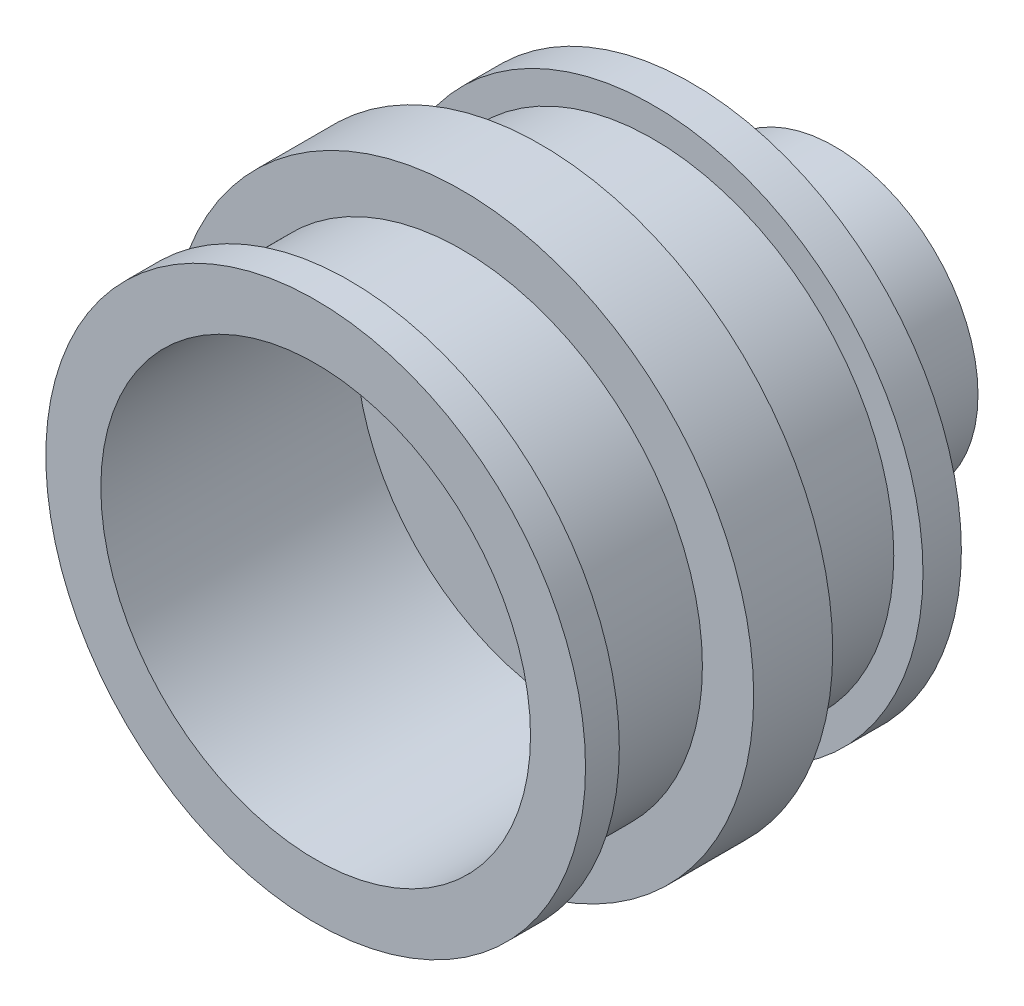
ISO-10303-21;
HEADER;
FILE_DESCRIPTION(('STEP AP214'),'2;1');
FILE_NAME('part.step','',(''),(''),'','','');
FILE_SCHEMA(('AUTOMOTIVE_DESIGN { 1 0 10303 214 1 1 1 1 }'));
ENDSEC;
DATA;
#1=APPLICATION_CONTEXT('core data for automotive mechanical design processes');
#2=APPLICATION_PROTOCOL_DEFINITION('international standard','automotive_design',2000,#1);
#3=PRODUCT_CONTEXT('',#1,'mechanical');
#4=PRODUCT('Part','Part','',(#3));
#5=PRODUCT_RELATED_PRODUCT_CATEGORY('part','',(#4));
#6=PRODUCT_DEFINITION_FORMATION('','',#4);
#7=PRODUCT_DEFINITION_CONTEXT('part definition',#1,'design');
#8=PRODUCT_DEFINITION('design','',#6,#7);
#9=PRODUCT_DEFINITION_SHAPE('','',#8);
#10=(LENGTH_UNIT() NAMED_UNIT(*) SI_UNIT(.MILLI.,.METRE.));
#11=(NAMED_UNIT(*) PLANE_ANGLE_UNIT() SI_UNIT($,.RADIAN.));
#12=(NAMED_UNIT(*) SI_UNIT($,.STERADIAN.) SOLID_ANGLE_UNIT());
#13=UNCERTAINTY_MEASURE_WITH_UNIT(LENGTH_MEASURE(1.E-05),#10,'distance_accuracy_value','');
#14=(GEOMETRIC_REPRESENTATION_CONTEXT(3) GLOBAL_UNCERTAINTY_ASSIGNED_CONTEXT((#13)) GLOBAL_UNIT_ASSIGNED_CONTEXT((#10,
#11,#12)) REPRESENTATION_CONTEXT('',''));
#15=CARTESIAN_POINT('',(0.,0.,0.));
#16=DIRECTION('',(0.,0.,1.));
#17=DIRECTION('',(1.,0.,0.));
#18=AXIS2_PLACEMENT_3D('',#15,#16,#17);
#19=CARTESIAN_POINT('',(0.,0.,0.));
#20=DIRECTION('',(0.,0.,1.));
#21=DIRECTION('',(1.,0.,0.));
#22=AXIS2_PLACEMENT_3D('',#19,#20,#21);
#23=PLANE('',#22);
#24=CARTESIAN_POINT('',(0.,0.,0.));
#25=DIRECTION('',(0.,0.,1.));
#26=DIRECTION('',(1.,0.,0.));
#27=AXIS2_PLACEMENT_3D('',#24,#25,#26);
#28=CIRCLE('',#27,9.42);
#29=CARTESIAN_POINT('',(9.42,0.,0.));
#30=VERTEX_POINT('',#29);
#31=EDGE_CURVE('E52',#30,#30,#28,.T.);
#32=ORIENTED_EDGE('',*,*,#31,.F.);
#33=EDGE_LOOP('',(#32));
#34=FACE_BOUND('',#33,.T.);
#35=CARTESIAN_POINT('',(0.,0.,0.));
#36=DIRECTION('',(0.,0.,1.));
#37=DIRECTION('',(1.,0.,0.));
#38=AXIS2_PLACEMENT_3D('',#35,#36,#37);
#39=CIRCLE('',#38,5.);
#40=CARTESIAN_POINT('',(5.,0.,0.));
#41=VERTEX_POINT('',#40);
#42=EDGE_CURVE('E10',#41,#41,#39,.F.);
#43=ORIENTED_EDGE('',*,*,#42,.F.);
#44=EDGE_LOOP('',(#43));
#45=FACE_BOUND('',#44,.T.);
#46=ADVANCED_FACE('F34',(#34,#45),#23,.F.);
#47=CARTESIAN_POINT('',(0.,0.,1.34));
#48=DIRECTION('',(0.,0.,-1.));
#49=DIRECTION('',(-1.,0.,0.));
#50=AXIS2_PLACEMENT_3D('',#47,#48,#49);
#51=CYLINDRICAL_SURFACE('',#50,9.42);
#52=CARTESIAN_POINT('',(0.,0.,1.34));
#53=DIRECTION('',(0.,0.,1.));
#54=DIRECTION('',(1.,0.,0.));
#55=AXIS2_PLACEMENT_3D('',#52,#53,#54);
#56=CIRCLE('',#55,9.42);
#57=CARTESIAN_POINT('',(9.42,0.,1.34));
#58=VERTEX_POINT('',#57);
#59=EDGE_CURVE('E47',#58,#58,#56,.T.);
#60=ORIENTED_EDGE('',*,*,#59,.F.);
#61=EDGE_LOOP('',(#60));
#62=FACE_BOUND('',#61,.T.);
#63=ORIENTED_EDGE('',*,*,#31,.T.);
#64=EDGE_LOOP('',(#63));
#65=FACE_BOUND('',#64,.T.);
#66=ADVANCED_FACE('F36',(#62,#65),#51,.T.);
#67=CARTESIAN_POINT('',(0.,0.,1.34));
#68=DIRECTION('',(0.,0.,1.));
#69=DIRECTION('',(1.,0.,0.));
#70=AXIS2_PLACEMENT_3D('',#67,#68,#69);
#71=PLANE('',#70);
#72=CARTESIAN_POINT('',(0.,0.,1.34));
#73=DIRECTION('',(0.,0.,1.));
#74=DIRECTION('',(1.,0.,0.));
#75=AXIS2_PLACEMENT_3D('',#72,#73,#74);
#76=CIRCLE('',#75,8.4);
#77=CARTESIAN_POINT('',(8.4,0.,1.34));
#78=VERTEX_POINT('',#77);
#79=EDGE_CURVE('E146',#78,#78,#76,.T.);
#80=ORIENTED_EDGE('',*,*,#79,.F.);
#81=EDGE_LOOP('',(#80));
#82=FACE_BOUND('',#81,.T.);
#83=ORIENTED_EDGE('',*,*,#59,.T.);
#84=EDGE_LOOP('',(#83));
#85=FACE_BOUND('',#84,.T.);
#86=ADVANCED_FACE('F130',(#82,#85),#71,.T.);
#87=CARTESIAN_POINT('',(0.,0.,5.26));
#88=DIRECTION('',(0.,0.,-1.));
#89=DIRECTION('',(-1.,0.,0.));
#90=AXIS2_PLACEMENT_3D('',#87,#88,#89);
#91=CYLINDRICAL_SURFACE('',#90,8.4);
#92=CARTESIAN_POINT('',(0.,0.,5.26));
#93=DIRECTION('',(0.,0.,1.));
#94=DIRECTION('',(1.,0.,0.));
#95=AXIS2_PLACEMENT_3D('',#92,#93,#94);
#96=CIRCLE('',#95,8.4);
#97=CARTESIAN_POINT('',(8.4,0.,5.26));
#98=VERTEX_POINT('',#97);
#99=EDGE_CURVE('E144',#98,#98,#96,.T.);
#100=ORIENTED_EDGE('',*,*,#99,.F.);
#101=EDGE_LOOP('',(#100));
#102=FACE_BOUND('',#101,.T.);
#103=ORIENTED_EDGE('',*,*,#79,.T.);
#104=EDGE_LOOP('',(#103));
#105=FACE_BOUND('',#104,.T.);
#106=ADVANCED_FACE('F126',(#102,#105),#91,.T.);
#107=CARTESIAN_POINT('',(0.,0.,8.02));
#108=DIRECTION('',(0.,0.,-1.));
#109=DIRECTION('',(-1.,0.,0.));
#110=AXIS2_PLACEMENT_3D('',#107,#108,#109);
#111=CYLINDRICAL_SURFACE('',#110,10.19);
#112=CARTESIAN_POINT('',(0.,0.,8.02));
#113=DIRECTION('',(0.,0.,1.));
#114=DIRECTION('',(1.,0.,0.));
#115=AXIS2_PLACEMENT_3D('',#112,#113,#114);
#116=CIRCLE('',#115,10.19);
#117=CARTESIAN_POINT('',(10.19,0.,8.02));
#118=VERTEX_POINT('',#117);
#119=EDGE_CURVE('E150',#118,#118,#116,.T.);
#120=ORIENTED_EDGE('',*,*,#119,.F.);
#121=EDGE_LOOP('',(#120));
#122=FACE_BOUND('',#121,.T.);
#123=CARTESIAN_POINT('',(0.,0.,5.26));
#124=DIRECTION('',(0.,0.,1.));
#125=DIRECTION('',(1.,0.,0.));
#126=AXIS2_PLACEMENT_3D('',#123,#124,#125);
#127=CIRCLE('',#126,10.19);
#128=CARTESIAN_POINT('',(10.19,0.,5.26));
#129=VERTEX_POINT('',#128);
#130=EDGE_CURVE('E153',#129,#129,#127,.T.);
#131=ORIENTED_EDGE('',*,*,#130,.T.);
#132=EDGE_LOOP('',(#131));
#133=FACE_BOUND('',#132,.T.);
#134=ADVANCED_FACE('F119',(#122,#133),#111,.T.);
#135=CARTESIAN_POINT('',(0.,0.,8.02));
#136=DIRECTION('',(0.,0.,1.));
#137=DIRECTION('',(1.,0.,0.));
#138=AXIS2_PLACEMENT_3D('',#135,#136,#137);
#139=PLANE('',#138);
#140=CARTESIAN_POINT('',(0.,0.,8.02));
#141=DIRECTION('',(0.,0.,1.));
#142=DIRECTION('',(1.,0.,0.));
#143=AXIS2_PLACEMENT_3D('',#140,#141,#142);
#144=CIRCLE('',#143,8.4);
#145=CARTESIAN_POINT('',(8.4,0.,8.02));
#146=VERTEX_POINT('',#145);
#147=EDGE_CURVE('E159',#146,#146,#144,.T.);
#148=ORIENTED_EDGE('',*,*,#147,.F.);
#149=EDGE_LOOP('',(#148));
#150=FACE_BOUND('',#149,.T.);
#151=ORIENTED_EDGE('',*,*,#119,.T.);
#152=EDGE_LOOP('',(#151));
#153=FACE_BOUND('',#152,.T.);
#154=ADVANCED_FACE('F116',(#150,#153),#139,.T.);
#155=CARTESIAN_POINT('',(0.,0.,5.26));
#156=DIRECTION('',(0.,0.,1.));
#157=DIRECTION('',(1.,0.,0.));
#158=AXIS2_PLACEMENT_3D('',#155,#156,#157);
#159=PLANE('',#158);
#160=ORIENTED_EDGE('',*,*,#99,.T.);
#161=EDGE_LOOP('',(#160));
#162=FACE_BOUND('',#161,.T.);
#163=ORIENTED_EDGE('',*,*,#130,.F.);
#164=EDGE_LOOP('',(#163));
#165=FACE_BOUND('',#164,.T.);
#166=ADVANCED_FACE('F114',(#162,#165),#159,.F.);
#167=CARTESIAN_POINT('',(0.,0.,11.94));
#168=DIRECTION('',(0.,0.,-1.));
#169=DIRECTION('',(-1.,0.,0.));
#170=AXIS2_PLACEMENT_3D('',#167,#168,#169);
#171=CYLINDRICAL_SURFACE('',#170,8.4);
#172=CARTESIAN_POINT('',(0.,0.,11.94));
#173=DIRECTION('',(0.,0.,1.));
#174=DIRECTION('',(1.,0.,0.));
#175=AXIS2_PLACEMENT_3D('',#172,#173,#174);
#176=CIRCLE('',#175,8.4);
#177=CARTESIAN_POINT('',(8.4,0.,11.94));
#178=VERTEX_POINT('',#177);
#179=EDGE_CURVE('E156',#178,#178,#176,.T.);
#180=ORIENTED_EDGE('',*,*,#179,.F.);
#181=EDGE_LOOP('',(#180));
#182=FACE_BOUND('',#181,.T.);
#183=ORIENTED_EDGE('',*,*,#147,.T.);
#184=EDGE_LOOP('',(#183));
#185=FACE_BOUND('',#184,.T.);
#186=ADVANCED_FACE('F110',(#182,#185),#171,.T.);
#187=CARTESIAN_POINT('',(0.,0.,13.12));
#188=DIRECTION('',(0.,0.,-1.));
#189=DIRECTION('',(-1.,0.,0.));
#190=AXIS2_PLACEMENT_3D('',#187,#188,#189);
#191=CYLINDRICAL_SURFACE('',#190,9.42);
#192=CARTESIAN_POINT('',(0.,0.,13.12));
#193=DIRECTION('',(0.,0.,1.));
#194=DIRECTION('',(1.,0.,0.));
#195=AXIS2_PLACEMENT_3D('',#192,#193,#194);
#196=CIRCLE('',#195,9.42);
#197=CARTESIAN_POINT('',(9.42,0.,13.12));
#198=VERTEX_POINT('',#197);
#199=EDGE_CURVE('E162',#198,#198,#196,.T.);
#200=ORIENTED_EDGE('',*,*,#199,.F.);
#201=EDGE_LOOP('',(#200));
#202=FACE_BOUND('',#201,.T.);
#203=CARTESIAN_POINT('',(0.,0.,11.94));
#204=DIRECTION('',(0.,0.,1.));
#205=DIRECTION('',(1.,0.,0.));
#206=AXIS2_PLACEMENT_3D('',#203,#204,#205);
#207=CIRCLE('',#206,9.42);
#208=CARTESIAN_POINT('',(9.42,0.,11.94));
#209=VERTEX_POINT('',#208);
#210=EDGE_CURVE('E165',#209,#209,#207,.T.);
#211=ORIENTED_EDGE('',*,*,#210,.T.);
#212=EDGE_LOOP('',(#211));
#213=FACE_BOUND('',#212,.T.);
#214=ADVANCED_FACE('F103',(#202,#213),#191,.T.);
#215=CARTESIAN_POINT('',(0.,0.,13.12));
#216=DIRECTION('',(0.,0.,1.));
#217=DIRECTION('',(1.,0.,0.));
#218=AXIS2_PLACEMENT_3D('',#215,#216,#217);
#219=PLANE('',#218);
#220=CARTESIAN_POINT('',(0.,0.,13.12));
#221=DIRECTION('',(0.,0.,1.));
#222=DIRECTION('',(1.,0.,0.));
#223=AXIS2_PLACEMENT_3D('',#220,#221,#222);
#224=CIRCLE('',#223,7.5);
#225=CARTESIAN_POINT('',(7.5,0.,13.12));
#226=VERTEX_POINT('',#225);
#227=EDGE_CURVE('E171',#226,#226,#224,.T.);
#228=ORIENTED_EDGE('',*,*,#227,.F.);
#229=EDGE_LOOP('',(#228));
#230=FACE_BOUND('',#229,.T.);
#231=ORIENTED_EDGE('',*,*,#199,.T.);
#232=EDGE_LOOP('',(#231));
#233=FACE_BOUND('',#232,.T.);
#234=ADVANCED_FACE('F100',(#230,#233),#219,.T.);
#235=CARTESIAN_POINT('',(0.,0.,11.94));
#236=DIRECTION('',(0.,0.,1.));
#237=DIRECTION('',(1.,0.,0.));
#238=AXIS2_PLACEMENT_3D('',#235,#236,#237);
#239=PLANE('',#238);
#240=ORIENTED_EDGE('',*,*,#179,.T.);
#241=EDGE_LOOP('',(#240));
#242=FACE_BOUND('',#241,.T.);
#243=ORIENTED_EDGE('',*,*,#210,.F.);
#244=EDGE_LOOP('',(#243));
#245=FACE_BOUND('',#244,.T.);
#246=ADVANCED_FACE('F98',(#242,#245),#239,.F.);
#247=CARTESIAN_POINT('',(0.,0.,4.22));
#248=DIRECTION('',(0.,0.,1.));
#249=DIRECTION('',(1.,0.,0.));
#250=AXIS2_PLACEMENT_3D('',#247,#248,#249);
#251=CYLINDRICAL_SURFACE('',#250,7.5);
#252=CARTESIAN_POINT('',(0.,0.,4.22));
#253=DIRECTION('',(0.,0.,1.));
#254=DIRECTION('',(1.,0.,0.));
#255=AXIS2_PLACEMENT_3D('',#252,#253,#254);
#256=CIRCLE('',#255,7.5);
#257=CARTESIAN_POINT('',(7.5,0.,4.22));
#258=VERTEX_POINT('',#257);
#259=EDGE_CURVE('E168',#258,#258,#256,.T.);
#260=ORIENTED_EDGE('',*,*,#259,.F.);
#261=EDGE_LOOP('',(#260));
#262=FACE_BOUND('',#261,.T.);
#263=ORIENTED_EDGE('',*,*,#227,.T.);
#264=EDGE_LOOP('',(#263));
#265=FACE_BOUND('',#264,.T.);
#266=ADVANCED_FACE('F94',(#262,#265),#251,.F.);
#267=CARTESIAN_POINT('',(0.,0.,4.22));
#268=DIRECTION('',(0.,0.,1.));
#269=DIRECTION('',(1.,0.,0.));
#270=AXIS2_PLACEMENT_3D('',#267,#268,#269);
#271=PLANE('',#270);
#272=CARTESIAN_POINT('',(0.,0.,4.22));
#273=DIRECTION('',(0.,0.,1.));
#274=DIRECTION('',(1.,0.,0.));
#275=AXIS2_PLACEMENT_3D('',#272,#273,#274);
#276=CIRCLE('',#275,1.5);
#277=CARTESIAN_POINT('',(1.5,0.,4.22));
#278=VERTEX_POINT('',#277);
#279=EDGE_CURVE('E174',#278,#278,#276,.F.);
#280=ORIENTED_EDGE('',*,*,#279,.T.);
#281=EDGE_LOOP('',(#280));
#282=FACE_BOUND('',#281,.T.);
#283=ORIENTED_EDGE('',*,*,#259,.T.);
#284=EDGE_LOOP('',(#283));
#285=FACE_BOUND('',#284,.T.);
#286=ADVANCED_FACE('F89',(#282,#285),#271,.T.);
#287=CARTESIAN_POINT('',(0.,0.,13.121));
#288=DIRECTION('',(0.,0.,-1.));
#289=DIRECTION('',(-1.,0.,0.));
#290=AXIS2_PLACEMENT_3D('',#287,#288,#289);
#291=CYLINDRICAL_SURFACE('',#290,1.5);
#292=CARTESIAN_POINT('',(0.,-1.5,-1.73218290112952));
#293=CARTESIAN_POINT('',(-0.0339680725271606,-1.49999711723688,-1.73218671255384));
#294=CARTESIAN_POINT('',(-0.0679871300259503,-1.49883288117063,-1.73492457272496));
#295=CARTESIAN_POINT('',(-0.135058940929918,-1.49428795252081,-1.74577767112911));
#296=CARTESIAN_POINT('',(-0.168108990676549,-1.49090157992629,-1.75390669029201));
#297=CARTESIAN_POINT('',(-0.232161769356809,-1.48227573278899,-1.77518597455708));
#298=CARTESIAN_POINT('',(-0.263171100826739,-1.47704262234619,-1.78831900741041));
#299=CARTESIAN_POINT('',(-0.322515617951797,-1.46523048983813,-1.81916123415922));
#300=CARTESIAN_POINT('',(-0.350851562671101,-1.45865185150414,-1.83686912372874));
#301=CARTESIAN_POINT('',(-0.405549695745048,-1.44442562698317,-1.87732043073597));
#302=CARTESIAN_POINT('',(-0.43175626623228,-1.43674230749715,-1.9002615881142));
#303=CARTESIAN_POINT('',(-0.480084629896048,-1.42132455342652,-1.95010976786903));
#304=CARTESIAN_POINT('',(-0.502204207608892,-1.41359009345896,-1.97701892707978));
#305=CARTESIAN_POINT('',(-0.542850466172014,-1.39850200627308,-2.0357071916887));
#306=CARTESIAN_POINT('',(-0.561135383580846,-1.39118811747449,-2.06766503329471));
#307=CARTESIAN_POINT('',(-0.592000642641176,-1.37833843106538,-2.13455670306307));
#308=CARTESIAN_POINT('',(-0.604584016316701,-1.37280168884398,-2.1694889377037));
#309=CARTESIAN_POINT('',(-0.623041105520848,-1.36452121866552,-2.23954633754983));
#310=CARTESIAN_POINT('',(-0.629214850233176,-1.36165332326669,-2.27457720397829));
#311=CARTESIAN_POINT('',(-0.635612866037319,-1.35867953257962,-2.345285978149));
#312=CARTESIAN_POINT('',(-0.635840572173658,-1.35857204259739,-2.38096350039349));
#313=CARTESIAN_POINT('',(-0.630565489019688,-1.36102647054083,-2.44891888842243));
#314=CARTESIAN_POINT('',(-0.625517503800053,-1.36337653836368,-2.48124126855019));
#315=CARTESIAN_POINT('',(-0.6105990666973,-1.37012228672774,-2.54452773258541));
#316=CARTESIAN_POINT('',(-0.600727655732607,-1.37451837408765,-2.57549154502269));
#317=CARTESIAN_POINT('',(-0.576248864508122,-1.38496097913759,-2.63597674325421));
#318=CARTESIAN_POINT('',(-0.56154381634206,-1.39104108714535,-2.66545254126695));
#319=CARTESIAN_POINT('',(-0.527884467526634,-1.40415944481124,-2.72163526540089));
#320=CARTESIAN_POINT('',(-0.508928461476086,-1.41119807856483,-2.74834107395024));
#321=CARTESIAN_POINT('',(-0.465358965689173,-1.42618937553484,-2.80068545417739));
#322=CARTESIAN_POINT('',(-0.44039556524339,-1.43416812505029,-2.82602614485986));
#323=CARTESIAN_POINT('',(-0.386496965861146,-1.44962256461992,-2.87226327579837));
#324=CARTESIAN_POINT('',(-0.357560779048988,-1.45709812886054,-2.89315860736327));
#325=CARTESIAN_POINT('',(-0.295607864726406,-1.47093384485599,-2.93036808481168));
#326=CARTESIAN_POINT('',(-0.262508470940529,-1.47726214729729,-2.94655731871931));
#327=CARTESIAN_POINT('',(-0.19371956578365,-1.48784425590235,-2.97303250484017));
#328=CARTESIAN_POINT('',(-0.15803154643209,-1.4920992463263,-2.98332182763335));
#329=CARTESIAN_POINT('',(-0.0875645860201082,-1.49783186828785,-2.99707298072396));
#330=CARTESIAN_POINT('',(-0.0528768045557571,-1.49947173297786,-3.00093434114269));
#331=CARTESIAN_POINT('',(0.0166871926703486,-1.5003099778756,-3.00291573141179));
#332=CARTESIAN_POINT('',(0.0515633489794482,-1.49950908805349,-3.00103747784031));
#333=CARTESIAN_POINT('',(0.118618293605912,-1.49566055028035,-2.99187562378236));
#334=CARTESIAN_POINT('',(0.150843418744581,-1.49273093518382,-2.98487586256323));
#335=CARTESIAN_POINT('',(0.213624599237952,-1.48504727417688,-2.96606836461912));
#336=CARTESIAN_POINT('',(0.244180444904984,-1.48029299965985,-2.9542600254292));
#337=CARTESIAN_POINT('',(0.303832359980417,-1.46922948315535,-2.92578593200706));
#338=CARTESIAN_POINT('',(0.332853226422732,-1.46287638646455,-2.90898022684304));
#339=CARTESIAN_POINT('',(0.387767298781577,-1.44928879768363,-2.87114178959404));
#340=CARTESIAN_POINT('',(0.413659174124155,-1.44205393323835,-2.85010726930179));
#341=CARTESIAN_POINT('',(0.463586290290881,-1.426821083577,-2.80259744220318));
#342=CARTESIAN_POINT('',(0.487344307651161,-1.41880614069932,-2.77583550443628));
#343=CARTESIAN_POINT('',(0.530113242171951,-1.40338806518479,-2.71858301601058));
#344=CARTESIAN_POINT('',(0.549122948979199,-1.39598508886045,-2.68809151762436));
#345=CARTESIAN_POINT('',(0.582098943976363,-1.38256438114197,-2.62354141573023));
#346=CARTESIAN_POINT('',(0.595978143284915,-1.37657114744551,-2.58943284675768));
#347=CARTESIAN_POINT('',(0.617674456370716,-1.3669753483036,-2.51902836023129));
#348=CARTESIAN_POINT('',(0.62549678704374,-1.36337072588878,-2.48273435414512));
#349=CARTESIAN_POINT('',(0.634331051914953,-1.35928129404169,-2.41207545074941));
#350=CARTESIAN_POINT('',(0.635831762181871,-1.35857271076448,-2.37778437411846));
#351=CARTESIAN_POINT('',(0.63329365239551,-1.35975778460091,-2.30945731263898));
#352=CARTESIAN_POINT('',(0.629255751140994,-1.3616510101013,-2.27542128642189));
#353=CARTESIAN_POINT('',(0.616169963229558,-1.36761905931841,-2.21031325020394));
#354=CARTESIAN_POINT('',(0.607380469147167,-1.37158103414721,-2.1791779562823));
#355=CARTESIAN_POINT('',(0.585298208047201,-1.38114807943981,-2.11881922502793));
#356=CARTESIAN_POINT('',(0.572004167282084,-1.38675361459157,-2.08959633125504));
#357=CARTESIAN_POINT('',(0.540354842701684,-1.39940114468736,-2.03193893340837));
#358=CARTESIAN_POINT('',(0.521739664767675,-1.40651004224381,-2.00366205267848));
#359=CARTESIAN_POINT('',(0.480334097091596,-1.42118304143599,-1.9504805915258));
#360=CARTESIAN_POINT('',(0.457542185764916,-1.42874730828628,-1.92557724585136));
#361=CARTESIAN_POINT('',(0.406370270011803,-1.44417088650439,-1.87789555431666));
#362=CARTESIAN_POINT('',(0.377696797387187,-1.452008760681,-1.85542372026134));
#363=CARTESIAN_POINT('',(0.316698457553392,-1.46652087407922,-1.81559113841568));
#364=CARTESIAN_POINT('',(0.284371942072359,-1.47319458454185,-1.79823271066381));
#365=CARTESIAN_POINT('',(0.217442950299297,-1.48453800679381,-1.76947885090048));
#366=CARTESIAN_POINT('',(0.182883466105657,-1.48923714883288,-1.75799524845847));
#367=CARTESIAN_POINT('',(0.112143261863595,-1.49622082013289,-1.7411137905066));
#368=CARTESIAN_POINT('',(0.075967957236825,-1.4985128641809,-1.73569699133151));
#369=CARTESIAN_POINT('',(0.0264329172631644,-1.49982632746691,-1.73259407548151));
#370=CARTESIAN_POINT('',(0.0132203201163018,-1.50000112196685,-1.7321814177292));
#371=CARTESIAN_POINT('',(0.,-1.5,-1.73218290112952));
#372=B_SPLINE_CURVE_WITH_KNOTS('',3,(#292,#293,#294,#295,#296,#297,#298,#299,#300,#301,#302,
#303,#304,#305,#306,#307,#308,#309,#310,#311,#312,#313,#314,#315,#316,#317,#318,#319,#320,#321,
#322,#323,#324,#325,#326,#327,#328,#329,#330,#331,#332,#333,#334,#335,#336,#337,#338,#339,#340,
#341,#342,#343,#344,#345,#346,#347,#348,#349,#350,#351,#352,#353,#354,#355,#356,#357,#358,#359,
#360,#361,#362,#363,#364,#365,#366,#367,#368,#369,#370,#371),.UNSPECIFIED.,.T.,.F.,(4,2,2,2,2,2,
2,2,2,2,2,2,2,2,2,2,2,2,2,2,2,2,2,2,2,2,2,2,2,2,2,2,2,2,2,2,2,2,2,4),(0.,0.101865695923008,
0.203992790708949,0.305771324814947,0.407520873059332,0.514058291843058,0.620653293727669,
0.732702719899017,0.844692489167285,0.951164709223208,1.05757541859298,1.15551397764473,
1.25347201855848,1.35354542069836,1.45365904238163,1.56253315392607,1.67143438737812,
1.78300623640394,1.89451428150607,1.99879023387438,2.10303500290857,2.20190218654423,
2.30078176102566,2.40274384179445,2.50474912953508,2.61426776238086,2.72381428330814,
2.83514313282212,2.94637598569168,3.0488299444073,3.15126690911885,3.24862369303404,
3.34600802946543,3.44935053134441,3.55273075602541,3.6639883274577,3.77529630084577,
3.88488075774608,3.99412207351006,4.0337680412904),.UNSPECIFIED.);
#373=CARTESIAN_POINT('',(0.,-1.5,-1.73218290112952));
#374=VERTEX_POINT('',#373);
#375=EDGE_CURVE('E80',#374,#374,#372,.T.);
#376=ORIENTED_EDGE('',*,*,#375,.T.);
#377=EDGE_LOOP('',(#376));
#378=FACE_BOUND('',#377,.T.);
#379=CARTESIAN_POINT('',(0.,1.5,-1.73218290112952));
#380=CARTESIAN_POINT('',(0.0339680725271608,1.49999711723688,-1.73218671255384));
#381=CARTESIAN_POINT('',(0.0679871300259507,1.49883288117063,-1.73492457272496));
#382=CARTESIAN_POINT('',(0.135058940929918,1.49428795252081,-1.74577767112911));
#383=CARTESIAN_POINT('',(0.16810899067655,1.49090157992629,-1.75390669029201));
#384=CARTESIAN_POINT('',(0.23216176935681,1.48227573278899,-1.77518597455708));
#385=CARTESIAN_POINT('',(0.263171100826739,1.47704262234619,-1.78831900741041));
#386=CARTESIAN_POINT('',(0.322515617951798,1.46523048983813,-1.81916123415922));
#387=CARTESIAN_POINT('',(0.350851562671102,1.45865185150414,-1.83686912372874));
#388=CARTESIAN_POINT('',(0.405549695745049,1.44442562698317,-1.87732043073597));
#389=CARTESIAN_POINT('',(0.431756266232281,1.43674230749715,-1.9002615881142));
#390=CARTESIAN_POINT('',(0.480084629896049,1.42132455342652,-1.95010976786903));
#391=CARTESIAN_POINT('',(0.502204207608893,1.41359009345896,-1.97701892707978));
#392=CARTESIAN_POINT('',(0.542850466172015,1.39850200627308,-2.0357071916887));
#393=CARTESIAN_POINT('',(0.561135383580847,1.39118811747449,-2.06766503329471));
#394=CARTESIAN_POINT('',(0.592000642641177,1.37833843106538,-2.13455670306307));
#395=CARTESIAN_POINT('',(0.604584016316702,1.37280168884398,-2.1694889377037));
#396=CARTESIAN_POINT('',(0.623041105520848,1.36452121866552,-2.23954633754983));
#397=CARTESIAN_POINT('',(0.629214850233176,1.36165332326669,-2.27457720397829));
#398=CARTESIAN_POINT('',(0.635612866037319,1.35867953257962,-2.345285978149));
#399=CARTESIAN_POINT('',(0.635840572173658,1.35857204259739,-2.3809635003935));
#400=CARTESIAN_POINT('',(0.630565489019688,1.36102647054083,-2.44891888842243));
#401=CARTESIAN_POINT('',(0.625517503800053,1.36337653836368,-2.48124126855019));
#402=CARTESIAN_POINT('',(0.6105990666973,1.37012228672774,-2.54452773258541));
#403=CARTESIAN_POINT('',(0.600727655732607,1.37451837408765,-2.57549154502269));
#404=CARTESIAN_POINT('',(0.576248864508122,1.38496097913759,-2.63597674325421));
#405=CARTESIAN_POINT('',(0.56154381634206,1.39104108714535,-2.66545254126695));
#406=CARTESIAN_POINT('',(0.527884467526634,1.40415944481124,-2.72163526540089));
#407=CARTESIAN_POINT('',(0.508928461476086,1.41119807856483,-2.74834107395024));
#408=CARTESIAN_POINT('',(0.465358965689174,1.42618937553484,-2.80068545417739));
#409=CARTESIAN_POINT('',(0.440395565243391,1.43416812505029,-2.82602614485986));
#410=CARTESIAN_POINT('',(0.386496965861147,1.44962256461992,-2.87226327579837));
#411=CARTESIAN_POINT('',(0.357560779048989,1.45709812886054,-2.89315860736327));
#412=CARTESIAN_POINT('',(0.295607864726408,1.47093384485599,-2.93036808481168));
#413=CARTESIAN_POINT('',(0.26250847094053,1.47726214729729,-2.94655731871931));
#414=CARTESIAN_POINT('',(0.193719565783651,1.48784425590235,-2.97303250484017));
#415=CARTESIAN_POINT('',(0.158031546432091,1.4920992463263,-2.98332182763335));
#416=CARTESIAN_POINT('',(0.0875645860201089,1.49783186828785,-2.99707298072396));
#417=CARTESIAN_POINT('',(0.0528768045557575,1.49947173297786,-3.00093434114269));
#418=CARTESIAN_POINT('',(-0.0166871926703485,1.5003099778756,-3.00291573141179));
#419=CARTESIAN_POINT('',(-0.0515633489794482,1.49950908805349,-3.00103747784031));
#420=CARTESIAN_POINT('',(-0.118618293605913,1.49566055028035,-2.99187562378236));
#421=CARTESIAN_POINT('',(-0.150843418744582,1.49273093518382,-2.98487586256323));
#422=CARTESIAN_POINT('',(-0.213624599237953,1.48504727417688,-2.96606836461912));
#423=CARTESIAN_POINT('',(-0.244180444904985,1.48029299965985,-2.9542600254292));
#424=CARTESIAN_POINT('',(-0.303832359980417,1.46922948315535,-2.92578593200706));
#425=CARTESIAN_POINT('',(-0.332853226422733,1.46287638646455,-2.90898022684304));
#426=CARTESIAN_POINT('',(-0.387767298781578,1.44928879768363,-2.87114178959404));
#427=CARTESIAN_POINT('',(-0.413659174124156,1.44205393323835,-2.85010726930179));
#428=CARTESIAN_POINT('',(-0.463586290290881,1.426821083577,-2.80259744220318));
#429=CARTESIAN_POINT('',(-0.487344307651161,1.41880614069932,-2.77583550443628));
#430=CARTESIAN_POINT('',(-0.530113242171951,1.40338806518479,-2.71858301601058));
#431=CARTESIAN_POINT('',(-0.5491229489792,1.39598508886045,-2.68809151762436));
#432=CARTESIAN_POINT('',(-0.582098943976363,1.38256438114197,-2.62354141573023));
#433=CARTESIAN_POINT('',(-0.595978143284916,1.37657114744551,-2.58943284675768));
#434=CARTESIAN_POINT('',(-0.617674456370716,1.3669753483036,-2.51902836023129));
#435=CARTESIAN_POINT('',(-0.62549678704374,1.36337072588878,-2.48273435414511));
#436=CARTESIAN_POINT('',(-0.634331051914953,1.35928129404169,-2.41207545074941));
#437=CARTESIAN_POINT('',(-0.635831762181871,1.35857271076448,-2.37778437411846));
#438=CARTESIAN_POINT('',(-0.633293652395509,1.35975778460092,-2.30945731263897));
#439=CARTESIAN_POINT('',(-0.629255751140994,1.3616510101013,-2.27542128642189));
#440=CARTESIAN_POINT('',(-0.616169963229558,1.36761905931841,-2.21031325020393));
#441=CARTESIAN_POINT('',(-0.607380469147167,1.37158103414721,-2.1791779562823));
#442=CARTESIAN_POINT('',(-0.585298208047201,1.38114807943981,-2.11881922502793));
#443=CARTESIAN_POINT('',(-0.572004167282084,1.38675361459157,-2.08959633125504));
#444=CARTESIAN_POINT('',(-0.540354842701685,1.39940114468736,-2.03193893340837));
#445=CARTESIAN_POINT('',(-0.521739664767676,1.40651004224381,-2.00366205267849));
#446=CARTESIAN_POINT('',(-0.480334097091597,1.42118304143599,-1.9504805915258));
#447=CARTESIAN_POINT('',(-0.457542185764917,1.42874730828628,-1.92557724585136));
#448=CARTESIAN_POINT('',(-0.406370270011804,1.44417088650439,-1.87789555431666));
#449=CARTESIAN_POINT('',(-0.377696797387188,1.452008760681,-1.85542372026134));
#450=CARTESIAN_POINT('',(-0.316698457553393,1.46652087407922,-1.81559113841568));
#451=CARTESIAN_POINT('',(-0.28437194207236,1.47319458454185,-1.79823271066381));
#452=CARTESIAN_POINT('',(-0.217442950299298,1.48453800679381,-1.76947885090048));
#453=CARTESIAN_POINT('',(-0.182883466105657,1.48923714883288,-1.75799524845847));
#454=CARTESIAN_POINT('',(-0.112143261863596,1.49622082013289,-1.7411137905066));
#455=CARTESIAN_POINT('',(-0.0759679572368255,1.4985128641809,-1.73569699133151));
#456=CARTESIAN_POINT('',(-0.0264329172631648,1.49982632746691,-1.73259407548151));
#457=CARTESIAN_POINT('',(-0.013220320116302,1.50000112196685,-1.7321814177292));
#458=CARTESIAN_POINT('',(0.,1.5,-1.73218290112952));
#459=B_SPLINE_CURVE_WITH_KNOTS('',3,(#379,#380,#381,#382,#383,#384,#385,#386,#387,#388,#389,
#390,#391,#392,#393,#394,#395,#396,#397,#398,#399,#400,#401,#402,#403,#404,#405,#406,#407,#408,
#409,#410,#411,#412,#413,#414,#415,#416,#417,#418,#419,#420,#421,#422,#423,#424,#425,#426,#427,
#428,#429,#430,#431,#432,#433,#434,#435,#436,#437,#438,#439,#440,#441,#442,#443,#444,#445,#446,
#447,#448,#449,#450,#451,#452,#453,#454,#455,#456,#457,#458),.UNSPECIFIED.,.T.,.F.,(4,2,2,2,2,2,
2,2,2,2,2,2,2,2,2,2,2,2,2,2,2,2,2,2,2,2,2,2,2,2,2,2,2,2,2,2,2,2,2,4),(0.,0.101865695923008,
0.203992790708949,0.305771324814947,0.407520873059333,0.514058291843059,0.62065329372767,
0.732702719899019,0.844692489167287,0.951164709223209,1.05757541859298,1.15551397764473,
1.25347201855848,1.35354542069836,1.45365904238163,1.56253315392607,1.67143438737812,
1.78300623640394,1.89451428150607,1.99879023387438,2.10303500290857,2.20190218654423,
2.30078176102567,2.40274384179445,2.50474912953508,2.61426776238086,2.72381428330814,
2.83514313282213,2.94637598569169,3.0488299444073,3.15126690911885,3.24862369303404,
3.34600802946542,3.4493505313444,3.55273075602541,3.6639883274577,3.77529630084576,
3.88488075774608,3.99412207351006,4.0337680412904),.UNSPECIFIED.);
#460=CARTESIAN_POINT('',(0.,1.5,-1.73218290112952));
#461=VERTEX_POINT('',#460);
#462=EDGE_CURVE('E75',#461,#461,#459,.T.);
#463=ORIENTED_EDGE('',*,*,#462,.T.);
#464=EDGE_LOOP('',(#463));
#465=FACE_BOUND('',#464,.T.);
#466=ORIENTED_EDGE('',*,*,#279,.F.);
#467=EDGE_LOOP('',(#466));
#468=FACE_BOUND('',#467,.T.);
#469=CARTESIAN_POINT('',(0.,0.,-5.));
#470=DIRECTION('',(0.,0.,-1.));
#471=DIRECTION('',(-1.,0.,0.));
#472=AXIS2_PLACEMENT_3D('',#469,#470,#471);
#473=CIRCLE('',#472,1.5);
#474=CARTESIAN_POINT('',(-1.5,0.,-5.));
#475=VERTEX_POINT('',#474);
#476=EDGE_CURVE('E181',#475,#475,#473,.T.);
#477=ORIENTED_EDGE('',*,*,#476,.T.);
#478=EDGE_LOOP('',(#477));
#479=FACE_BOUND('',#478,.T.);
#480=ADVANCED_FACE('F85',(#378,#465,#468,#479),#291,.F.);
#481=CARTESIAN_POINT('',(0.,0.,-5.));
#482=DIRECTION('',(0.,0.,-1.));
#483=DIRECTION('',(-1.,0.,0.));
#484=AXIS2_PLACEMENT_3D('',#481,#482,#483);
#485=PLANE('',#484);
#486=CARTESIAN_POINT('',(0.,0.,-5.));
#487=DIRECTION('',(0.,0.,-1.));
#488=DIRECTION('',(-1.,0.,0.));
#489=AXIS2_PLACEMENT_3D('',#486,#487,#488);
#490=CIRCLE('',#489,5.);
#491=CARTESIAN_POINT('',(-5.,0.,-5.));
#492=VERTEX_POINT('',#491);
#493=EDGE_CURVE('E179',#492,#492,#490,.T.);
#494=ORIENTED_EDGE('',*,*,#493,.T.);
#495=EDGE_LOOP('',(#494));
#496=FACE_BOUND('',#495,.T.);
#497=ORIENTED_EDGE('',*,*,#476,.F.);
#498=EDGE_LOOP('',(#497));
#499=FACE_BOUND('',#498,.T.);
#500=ADVANCED_FACE('F69',(#496,#499),#485,.T.);
#501=CARTESIAN_POINT('',(0.,0.,-5.));
#502=DIRECTION('',(0.,0.,1.));
#503=DIRECTION('',(1.,0.,0.));
#504=AXIS2_PLACEMENT_3D('',#501,#502,#503);
#505=CYLINDRICAL_SURFACE('',#504,5.);
#506=CARTESIAN_POINT('',(0.,-5.,-1.73218290112952));
#507=CARTESIAN_POINT('',(0.0355148750056346,-4.99999949806597,-1.73218440700971));
#508=CARTESIAN_POINT('',(0.071051826565438,-4.9996176140953,-1.73517241159478));
#509=CARTESIAN_POINT('',(0.141136531964831,-4.99813093783166,-1.74704479544378));
#510=CARTESIAN_POINT('',(0.175683219097827,-4.99702539446386,-1.75593530095854));
#511=CARTESIAN_POINT('',(0.242762655688232,-4.99421592231128,-1.77934624610998));
#512=CARTESIAN_POINT('',(0.275296755693473,-4.99251240003848,-1.79386286175754));
#513=CARTESIAN_POINT('',(0.337460920639897,-4.98869634588268,-1.82810551600029));
#514=CARTESIAN_POINT('',(0.367091475556606,-4.98658388318833,-1.84783067356706));
#515=CARTESIAN_POINT('',(0.422781698155724,-4.98217232822402,-1.89205013587102));
#516=CARTESIAN_POINT('',(0.448822511566748,-4.97987234454537,-1.9165680992505));
#517=CARTESIAN_POINT('',(0.496431648143836,-4.9753521418684,-1.96962639156408));
#518=CARTESIAN_POINT('',(0.517999741315329,-4.97313192697677,-1.99816692721872));
#519=CARTESIAN_POINT('',(0.556121667781587,-4.96901387826175,-2.05858304493785));
#520=CARTESIAN_POINT('',(0.572657792594462,-4.96711719305905,-2.09046988590497));
#521=CARTESIAN_POINT('',(0.600133285662412,-4.96387274190438,-2.15659612487961));
#522=CARTESIAN_POINT('',(0.611072872866681,-4.9625249544787,-2.19083543079391));
#523=CARTESIAN_POINT('',(0.626987366644489,-4.96053943299613,-2.26049878173888));
#524=CARTESIAN_POINT('',(0.631994143920765,-4.95989790628106,-2.29591543596431));
#525=CARTESIAN_POINT('',(0.635999520936371,-4.959385942298,-2.36709165350918));
#526=CARTESIAN_POINT('',(0.634998369824027,-4.95951547305432,-2.40285120254741));
#527=CARTESIAN_POINT('',(0.627042462511771,-4.96052751796945,-2.47347579319991));
#528=CARTESIAN_POINT('',(0.620122841714862,-4.96140558826993,-2.50834486558026));
#529=CARTESIAN_POINT('',(0.600581250714563,-4.96380884370424,-2.57642287549968));
#530=CARTESIAN_POINT('',(0.587959161573393,-4.96533404233535,-2.60963177839614));
#531=CARTESIAN_POINT('',(0.557333253709948,-4.96886473152532,-2.67355575625828));
#532=CARTESIAN_POINT('',(0.539314195110252,-4.97087157892486,-2.70426345181573));
#533=CARTESIAN_POINT('',(0.498416741884959,-4.97513840012026,-2.76223246347986));
#534=CARTESIAN_POINT('',(0.475538117863581,-4.97739838586314,-2.78949361679557));
#535=CARTESIAN_POINT('',(0.425376388817936,-4.98193658502493,-2.83999961477294));
#536=CARTESIAN_POINT('',(0.398063004479271,-4.98421481338433,-2.86321439575281));
#537=CARTESIAN_POINT('',(0.339911259234576,-4.98851771018297,-2.90473448787712));
#538=CARTESIAN_POINT('',(0.309072889747571,-4.99054237800494,-2.92303978706989));
#539=CARTESIAN_POINT('',(0.244723166576411,-4.99411134294388,-2.95422142952053));
#540=CARTESIAN_POINT('',(0.21121087520289,-4.99565547060683,-2.96709585824538));
#541=CARTESIAN_POINT('',(0.142476143630902,-4.99808784673821,-2.987026269155));
#542=CARTESIAN_POINT('',(0.107253786180612,-4.99897612690872,-2.99408253257772));
#543=CARTESIAN_POINT('',(0.0363586660193275,-4.99999259623494,-3.00213727226668));
#544=CARTESIAN_POINT('',(0.000690679452697524,-5.00012598086684,-3.00317715663341));
#545=CARTESIAN_POINT('',(-0.0703110650178015,-4.99963166629227,-2.99927894285047));
#546=CARTESIAN_POINT('',(-0.105644830257145,-4.99900398382891,-2.99434097621066));
#547=CARTESIAN_POINT('',(-0.174852715589378,-4.99706129883272,-2.97866163346021));
#548=CARTESIAN_POINT('',(-0.20873138727837,-4.99574863889073,-2.967940032914));
#549=CARTESIAN_POINT('',(-0.274209879628738,-4.99258294015916,-2.94101835093501));
#550=CARTESIAN_POINT('',(-0.305809620600317,-4.99072988248433,-2.92481807803625));
#551=CARTESIAN_POINT('',(-0.36601797245428,-4.986676981237,-2.88729895741261));
#552=CARTESIAN_POINT('',(-0.394609793029745,-4.98447534686631,-2.86595336243133));
#553=CARTESIAN_POINT('',(-0.447819785038054,-4.97997709201533,-2.81878731639196));
#554=CARTESIAN_POINT('',(-0.472437793376374,-4.9776804676413,-2.79296668175794));
#555=CARTESIAN_POINT('',(-0.517148538730574,-4.97323501414329,-2.73740096342993));
#556=CARTESIAN_POINT('',(-0.537213803972337,-4.97108713389641,-2.70763368766503));
#557=CARTESIAN_POINT('',(-0.572059611978103,-4.96719805470723,-2.64512720567179));
#558=CARTESIAN_POINT('',(-0.586840263550174,-4.96545684739195,-2.61238806065044));
#559=CARTESIAN_POINT('',(-0.610652938980834,-4.96258475332005,-2.54495532909765));
#560=CARTESIAN_POINT('',(-0.619700375477318,-4.96145223148735,-2.51026725788605));
#561=CARTESIAN_POINT('',(-0.631839391301329,-4.95992107137733,-2.43984889126648));
#562=CARTESIAN_POINT('',(-0.634931257372667,-4.95952239776733,-2.40411864612032));
#563=CARTESIAN_POINT('',(-0.635065989883811,-4.95950512480511,-2.33290352465858));
#564=CARTESIAN_POINT('',(-0.632152017588598,-4.95988095940731,-2.2974187236309));
#565=CARTESIAN_POINT('',(-0.620449269319243,-4.96135837941456,-2.227447637013));
#566=CARTESIAN_POINT('',(-0.611660493352104,-4.96245996481873,-2.1929613514216));
#567=CARTESIAN_POINT('',(-0.588471247337328,-4.96526302717609,-2.12597238045108));
#568=CARTESIAN_POINT('',(-0.574072926294111,-4.96696427437641,-2.09346894095655));
#569=CARTESIAN_POINT('',(-0.540077550873979,-4.97077534366717,-2.03133249699876));
#570=CARTESIAN_POINT('',(-0.520480423064615,-4.97288517152865,-2.00169953308866));
#571=CARTESIAN_POINT('',(-0.476483826004454,-4.97729383642381,-1.94592466872181));
#572=CARTESIAN_POINT('',(-0.452052200818677,-4.97959387550637,-1.91980822681318));
#573=CARTESIAN_POINT('',(-0.399147317184484,-4.98411323479464,-1.87202938989977));
#574=CARTESIAN_POINT('',(-0.370673108326164,-4.98633253586429,-1.85036804522741));
#575=CARTESIAN_POINT('',(-0.310362917978916,-4.99045000858643,-1.81204162280188));
#576=CARTESIAN_POINT('',(-0.278514187482514,-4.99234688640232,-1.79539647710696));
#577=CARTESIAN_POINT('',(-0.212467018832845,-4.99559271418918,-1.76771467329977));
#578=CARTESIAN_POINT('',(-0.178271170930225,-4.99694225717627,-1.75667194191439));
#579=CARTESIAN_POINT('',(-0.119916729427739,-4.9986172994347,-1.7431416170413));
#580=CARTESIAN_POINT('',(-0.0961255875382576,-4.99913327606872,-1.73903803191652));
#581=CARTESIAN_POINT('',(-0.0482263559019459,-4.99982479547285,-1.73355817313976));
#582=CARTESIAN_POINT('',(-0.0241182685977691,-5.00000034086505,-1.73218187848133));
#583=CARTESIAN_POINT('',(0.,-5.,-1.73218290112952));
#584=B_SPLINE_CURVE_WITH_KNOTS('',3,(#506,#507,#508,#509,#510,#511,#512,#513,#514,#515,#516,
#517,#518,#519,#520,#521,#522,#523,#524,#525,#526,#527,#528,#529,#530,#531,#532,#533,#534,#535,
#536,#537,#538,#539,#540,#541,#542,#543,#544,#545,#546,#547,#548,#549,#550,#551,#552,#553,#554,
#555,#556,#557,#558,#559,#560,#561,#562,#563,#564,#565,#566,#567,#568,#569,#570,#571,#572,#573,
#574,#575,#576,#577,#578,#579,#580,#581,#582,#583),.UNSPECIFIED.,.T.,.F.,(4,2,2,2,2,2,2,2,2,2,2,
2,2,2,2,2,2,2,2,2,2,2,2,2,2,2,2,2,2,2,2,2,2,2,2,2,2,2,4),(0.,0.106456526117322,
0.213023717373286,0.319518603054965,0.425995486580336,0.533011883975038,0.640033782963691,
0.747428069653802,0.854818154515461,0.961628692460703,1.06843480101178,1.17461121396681,
1.28078984157156,1.38727116767149,1.49375752133985,1.60100412654918,1.70825099283762,
1.81553563509968,1.92281509114237,2.02935530313457,2.13589317133592,2.24206905008454,
2.34824863979985,2.45499256708689,2.56174087428037,2.66911712814202,2.77649117104252,
2.88357532118753,2.99065431540579,3.09696646471035,3.20327861388816,3.30955007509993,
3.41582303746176,3.52282817643481,3.62985851406275,3.73730869724322,3.84464214928512,
3.91693768367077,3.98923266121119),.UNSPECIFIED.);
#585=CARTESIAN_POINT('',(0.,-5.,-1.73218290112952));
#586=VERTEX_POINT('',#585);
#587=EDGE_CURVE('E38',#586,#586,#584,.T.);
#588=ORIENTED_EDGE('',*,*,#587,.T.);
#589=EDGE_LOOP('',(#588));
#590=FACE_BOUND('',#589,.T.);
#591=CARTESIAN_POINT('',(0.,5.,-1.73218290112952));
#592=CARTESIAN_POINT('',(-0.0355148750056347,4.99999949806597,-1.73218440700971));
#593=CARTESIAN_POINT('',(-0.0710518265654381,4.9996176140953,-1.73517241159478));
#594=CARTESIAN_POINT('',(-0.141136531964832,4.99813093783166,-1.74704479544378));
#595=CARTESIAN_POINT('',(-0.175683219097827,4.99702539446386,-1.75593530095854));
#596=CARTESIAN_POINT('',(-0.242762655688232,4.99421592231128,-1.77934624610998));
#597=CARTESIAN_POINT('',(-0.275296755693474,4.99251240003848,-1.79386286175754));
#598=CARTESIAN_POINT('',(-0.337460920639897,4.98869634588268,-1.82810551600029));
#599=CARTESIAN_POINT('',(-0.367091475556606,4.98658388318833,-1.84783067356706));
#600=CARTESIAN_POINT('',(-0.422781698155724,4.98217232822402,-1.89205013587102));
#601=CARTESIAN_POINT('',(-0.448822511566749,4.97987234454537,-1.9165680992505));
#602=CARTESIAN_POINT('',(-0.496431648143837,4.9753521418684,-1.96962639156408));
#603=CARTESIAN_POINT('',(-0.517999741315329,4.97313192697677,-1.99816692721872));
#604=CARTESIAN_POINT('',(-0.556121667781587,4.96901387826175,-2.05858304493785));
#605=CARTESIAN_POINT('',(-0.572657792594462,4.96711719305905,-2.09046988590498));
#606=CARTESIAN_POINT('',(-0.600133285662412,4.96387274190438,-2.15659612487961));
#607=CARTESIAN_POINT('',(-0.611072872866681,4.9625249544787,-2.19083543079392));
#608=CARTESIAN_POINT('',(-0.626987366644489,4.96053943299613,-2.26049878173888));
#609=CARTESIAN_POINT('',(-0.631994143920765,4.95989790628106,-2.29591543596431));
#610=CARTESIAN_POINT('',(-0.63599952093637,4.959385942298,-2.36709165350918));
#611=CARTESIAN_POINT('',(-0.634998369824027,4.95951547305432,-2.40285120254741));
#612=CARTESIAN_POINT('',(-0.627042462511771,4.96052751796945,-2.47347579319991));
#613=CARTESIAN_POINT('',(-0.620122841714862,4.96140558826993,-2.50834486558026));
#614=CARTESIAN_POINT('',(-0.600581250714562,4.96380884370424,-2.57642287549968));
#615=CARTESIAN_POINT('',(-0.587959161573392,4.96533404233535,-2.60963177839614));
#616=CARTESIAN_POINT('',(-0.557333253709948,4.96886473152532,-2.67355575625828));
#617=CARTESIAN_POINT('',(-0.539314195110252,4.97087157892486,-2.70426345181573));
#618=CARTESIAN_POINT('',(-0.498416741884959,4.97513840012026,-2.76223246347986));
#619=CARTESIAN_POINT('',(-0.475538117863581,4.97739838586314,-2.78949361679557));
#620=CARTESIAN_POINT('',(-0.425376388817936,4.98193658502493,-2.83999961477294));
#621=CARTESIAN_POINT('',(-0.398063004479271,4.98421481338433,-2.86321439575281));
#622=CARTESIAN_POINT('',(-0.339911259234576,4.98851771018297,-2.90473448787712));
#623=CARTESIAN_POINT('',(-0.309072889747571,4.99054237800494,-2.92303978706989));
#624=CARTESIAN_POINT('',(-0.244723166576411,4.99411134294388,-2.95422142952053));
#625=CARTESIAN_POINT('',(-0.21121087520289,4.99565547060683,-2.96709585824538));
#626=CARTESIAN_POINT('',(-0.142476143630902,4.99808784673821,-2.987026269155));
#627=CARTESIAN_POINT('',(-0.107253786180612,4.99897612690872,-2.99408253257772));
#628=CARTESIAN_POINT('',(-0.0363586660193272,4.99999259623494,-3.00213727226668));
#629=CARTESIAN_POINT('',(-0.000690679452697192,5.00012598086684,-3.00317715663341));
#630=CARTESIAN_POINT('',(0.0703110650178019,4.99963166629227,-2.99927894285047));
#631=CARTESIAN_POINT('',(0.105644830257145,4.99900398382891,-2.99434097621066));
#632=CARTESIAN_POINT('',(0.174852715589378,4.99706129883272,-2.97866163346021));
#633=CARTESIAN_POINT('',(0.20873138727837,4.99574863889073,-2.967940032914));
#634=CARTESIAN_POINT('',(0.274209879628739,4.99258294015916,-2.94101835093501));
#635=CARTESIAN_POINT('',(0.305809620600317,4.99072988248433,-2.92481807803625));
#636=CARTESIAN_POINT('',(0.366017972454281,4.986676981237,-2.88729895741261));
#637=CARTESIAN_POINT('',(0.394609793029746,4.98447534686631,-2.86595336243133));
#638=CARTESIAN_POINT('',(0.447819785038054,4.97997709201533,-2.81878731639196));
#639=CARTESIAN_POINT('',(0.472437793376374,4.9776804676413,-2.79296668175794));
#640=CARTESIAN_POINT('',(0.517148538730575,4.97323501414329,-2.73740096342993));
#641=CARTESIAN_POINT('',(0.537213803972337,4.97108713389641,-2.70763368766503));
#642=CARTESIAN_POINT('',(0.572059611978104,4.96719805470723,-2.64512720567179));
#643=CARTESIAN_POINT('',(0.586840263550175,4.96545684739195,-2.61238806065044));
#644=CARTESIAN_POINT('',(0.610652938980834,4.96258475332005,-2.54495532909765));
#645=CARTESIAN_POINT('',(0.619700375477318,4.96145223148735,-2.51026725788605));
#646=CARTESIAN_POINT('',(0.631839391301329,4.95992107137733,-2.43984889126648));
#647=CARTESIAN_POINT('',(0.634931257372667,4.95952239776733,-2.40411864612032));
#648=CARTESIAN_POINT('',(0.635065989883811,4.95950512480511,-2.33290352465858));
#649=CARTESIAN_POINT('',(0.632152017588598,4.95988095940731,-2.2974187236309));
#650=CARTESIAN_POINT('',(0.620449269319242,4.96135837941456,-2.227447637013));
#651=CARTESIAN_POINT('',(0.611660493352103,4.96245996481873,-2.19296135142159));
#652=CARTESIAN_POINT('',(0.588471247337327,4.96526302717609,-2.12597238045108));
#653=CARTESIAN_POINT('',(0.574072926294111,4.96696427437641,-2.09346894095655));
#654=CARTESIAN_POINT('',(0.540077550873979,4.97077534366717,-2.03133249699876));
#655=CARTESIAN_POINT('',(0.520480423064615,4.97288517152865,-2.00169953308866));
#656=CARTESIAN_POINT('',(0.476483826004454,4.97729383642381,-1.94592466872181));
#657=CARTESIAN_POINT('',(0.452052200818677,4.97959387550637,-1.91980822681318));
#658=CARTESIAN_POINT('',(0.399147317184484,4.98411323479464,-1.87202938989977));
#659=CARTESIAN_POINT('',(0.370673108326164,4.98633253586429,-1.85036804522741));
#660=CARTESIAN_POINT('',(0.310362917978916,4.99045000858643,-1.81204162280188));
#661=CARTESIAN_POINT('',(0.278514187482514,4.99234688640232,-1.79539647710696));
#662=CARTESIAN_POINT('',(0.212467018832845,4.99559271418918,-1.76771467329977));
#663=CARTESIAN_POINT('',(0.178271170930224,4.99694225717627,-1.75667194191439));
#664=CARTESIAN_POINT('',(0.119916729427739,4.9986172994347,-1.7431416170413));
#665=CARTESIAN_POINT('',(0.0961255875382573,4.99913327606872,-1.73903803191652));
#666=CARTESIAN_POINT('',(0.0482263559019456,4.99982479547285,-1.73355817313976));
#667=CARTESIAN_POINT('',(0.0241182685977689,5.00000034086505,-1.73218187848133));
#668=CARTESIAN_POINT('',(0.,5.,-1.73218290112952));
#669=B_SPLINE_CURVE_WITH_KNOTS('',3,(#591,#592,#593,#594,#595,#596,#597,#598,#599,#600,#601,
#602,#603,#604,#605,#606,#607,#608,#609,#610,#611,#612,#613,#614,#615,#616,#617,#618,#619,#620,
#621,#622,#623,#624,#625,#626,#627,#628,#629,#630,#631,#632,#633,#634,#635,#636,#637,#638,#639,
#640,#641,#642,#643,#644,#645,#646,#647,#648,#649,#650,#651,#652,#653,#654,#655,#656,#657,#658,
#659,#660,#661,#662,#663,#664,#665,#666,#667,#668),.UNSPECIFIED.,.T.,.F.,(4,2,2,2,2,2,2,2,2,2,2,
2,2,2,2,2,2,2,2,2,2,2,2,2,2,2,2,2,2,2,2,2,2,2,2,2,2,2,4),(0.,0.106456526117322,
0.213023717373286,0.319518603054965,0.425995486580337,0.533011883975039,0.640033782963693,
0.747428069653803,0.854818154515462,0.961628692460704,1.06843480101178,1.17461121396681,
1.28078984157156,1.38727116767149,1.49375752133985,1.60100412654918,1.70825099283762,
1.81553563509968,1.92281509114237,2.02935530313457,2.13589317133592,2.24206905008454,
2.34824863979985,2.45499256708689,2.56174087428037,2.66911712814202,2.77649117104252,
2.88357532118753,2.99065431540579,3.09696646471035,3.20327861388816,3.30955007509993,
3.41582303746176,3.52282817643481,3.62985851406275,3.73730869724322,3.84464214928512,
3.91693768367078,3.98923266121119),.UNSPECIFIED.);
#670=CARTESIAN_POINT('',(0.,5.,-1.73218290112952));
#671=VERTEX_POINT('',#670);
#672=EDGE_CURVE('E55',#671,#671,#669,.T.);
#673=ORIENTED_EDGE('',*,*,#672,.T.);
#674=EDGE_LOOP('',(#673));
#675=FACE_BOUND('',#674,.T.);
#676=ORIENTED_EDGE('',*,*,#493,.F.);
#677=EDGE_LOOP('',(#676));
#678=FACE_BOUND('',#677,.T.);
#679=ORIENTED_EDGE('',*,*,#42,.T.);
#680=EDGE_LOOP('',(#679));
#681=FACE_BOUND('',#680,.T.);
#682=ADVANCED_FACE('F60',(#590,#675,#678,#681),#505,.T.);
#683=CARTESIAN_POINT('',(0.,-10.19,-2.36718290112952));
#684=DIRECTION('',(0.,1.,0.));
#685=DIRECTION('',(0.,0.,1.));
#686=AXIS2_PLACEMENT_3D('',#683,#684,#685);
#687=CYLINDRICAL_SURFACE('',#686,0.635);
#688=ORIENTED_EDGE('',*,*,#672,.F.);
#689=EDGE_LOOP('',(#688));
#690=FACE_BOUND('',#689,.T.);
#691=ORIENTED_EDGE('',*,*,#462,.F.);
#692=EDGE_LOOP('',(#691));
#693=FACE_BOUND('',#692,.T.);
#694=ADVANCED_FACE('F67',(#690,#693),#687,.F.);
#695=ORIENTED_EDGE('',*,*,#587,.F.);
#696=EDGE_LOOP('',(#695));
#697=FACE_BOUND('',#696,.T.);
#698=ORIENTED_EDGE('',*,*,#375,.F.);
#699=EDGE_LOOP('',(#698));
#700=FACE_BOUND('',#699,.T.);
#701=ADVANCED_FACE('F64',(#697,#700),#687,.F.);
#702=CLOSED_SHELL('',(#46,#66,#86,#106,#134,#154,#166,#186,#214,#234,#246,#266,#286,#480,#500,
#682,#694,#701));
#703=MANIFOLD_SOLID_BREP('B2',#702);
#704=ADVANCED_BREP_SHAPE_REPRESENTATION('',(#18,#703),#14);
#705=SHAPE_DEFINITION_REPRESENTATION(#9,#704);
ENDSEC;
END-ISO-10303-21;
